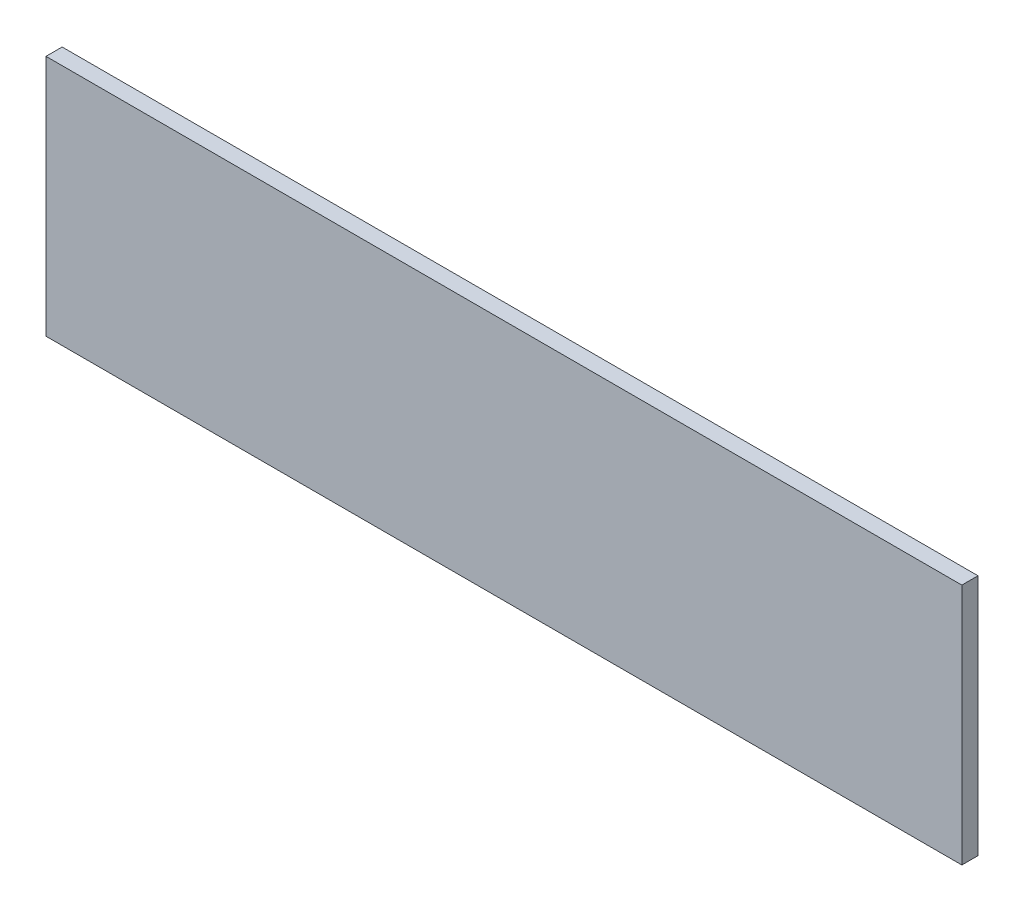
ISO-10303-21;
HEADER;
FILE_DESCRIPTION(('STEP AP214'),'2;1');
FILE_NAME('part.step','',(''),(''),'','','');
FILE_SCHEMA(('AUTOMOTIVE_DESIGN { 1 0 10303 214 1 1 1 1 }'));
ENDSEC;
DATA;
#1=APPLICATION_CONTEXT('core data for automotive mechanical design processes');
#2=APPLICATION_PROTOCOL_DEFINITION('international standard','automotive_design',2000,#1);
#3=PRODUCT_CONTEXT('',#1,'mechanical');
#4=PRODUCT('Part','Part','',(#3));
#5=PRODUCT_RELATED_PRODUCT_CATEGORY('part','',(#4));
#6=PRODUCT_DEFINITION_FORMATION('','',#4);
#7=PRODUCT_DEFINITION_CONTEXT('part definition',#1,'design');
#8=PRODUCT_DEFINITION('design','',#6,#7);
#9=PRODUCT_DEFINITION_SHAPE('','',#8);
#10=(LENGTH_UNIT() NAMED_UNIT(*) SI_UNIT(.MILLI.,.METRE.));
#11=(NAMED_UNIT(*) PLANE_ANGLE_UNIT() SI_UNIT($,.RADIAN.));
#12=(NAMED_UNIT(*) SI_UNIT($,.STERADIAN.) SOLID_ANGLE_UNIT());
#13=UNCERTAINTY_MEASURE_WITH_UNIT(LENGTH_MEASURE(1.E-05),#10,'distance_accuracy_value','');
#14=(GEOMETRIC_REPRESENTATION_CONTEXT(3) GLOBAL_UNCERTAINTY_ASSIGNED_CONTEXT((#13)) GLOBAL_UNIT_ASSIGNED_CONTEXT((#10,
#11,#12)) REPRESENTATION_CONTEXT('',''));
#15=CARTESIAN_POINT('',(0.,0.,0.));
#16=DIRECTION('',(0.,0.,1.));
#17=DIRECTION('',(1.,0.,0.));
#18=AXIS2_PLACEMENT_3D('',#15,#16,#17);
#19=CARTESIAN_POINT('',(0.,0.,3.));
#20=DIRECTION('',(1.,0.,0.));
#21=DIRECTION('',(0.,0.,-1.));
#22=AXIS2_PLACEMENT_3D('',#19,#20,#21);
#23=PLANE('',#22);
#24=DIRECTION('',(0.,-1.,0.));
#25=VECTOR('',#24,1.);
#26=CARTESIAN_POINT('',(0.,0.,0.));
#27=LINE('',#26,#25);
#28=CARTESIAN_POINT('',(0.,45.,0.));
#29=VERTEX_POINT('',#28);
#30=CARTESIAN_POINT('',(0.,0.,0.));
#31=VERTEX_POINT('',#30);
#32=EDGE_CURVE('E94',#29,#31,#27,.T.);
#33=ORIENTED_EDGE('',*,*,#32,.T.);
#34=DIRECTION('',(0.,0.,-1.));
#35=VECTOR('',#34,1.);
#36=CARTESIAN_POINT('',(0.,0.,3.));
#37=LINE('',#36,#35);
#38=CARTESIAN_POINT('',(0.,0.,3.));
#39=VERTEX_POINT('',#38);
#40=EDGE_CURVE('E11',#39,#31,#37,.T.);
#41=ORIENTED_EDGE('',*,*,#40,.F.);
#42=DIRECTION('',(0.,-1.,0.));
#43=VECTOR('',#42,1.);
#44=CARTESIAN_POINT('',(0.,0.,3.));
#45=LINE('',#44,#43);
#46=CARTESIAN_POINT('',(0.,45.,3.));
#47=VERTEX_POINT('',#46);
#48=EDGE_CURVE('E82',#47,#39,#45,.T.);
#49=ORIENTED_EDGE('',*,*,#48,.F.);
#50=DIRECTION('',(0.,0.,-1.));
#51=VECTOR('',#50,1.);
#52=CARTESIAN_POINT('',(0.,45.,3.));
#53=LINE('',#52,#51);
#54=EDGE_CURVE('E90',#47,#29,#53,.T.);
#55=ORIENTED_EDGE('',*,*,#54,.T.);
#56=EDGE_LOOP('',(#33,#41,#49,#55));
#57=FACE_BOUND('',#56,.T.);
#58=ADVANCED_FACE('F31',(#57),#23,.F.);
#59=CARTESIAN_POINT('',(0.,0.,3.));
#60=DIRECTION('',(0.,1.,0.));
#61=DIRECTION('',(0.,0.,1.));
#62=AXIS2_PLACEMENT_3D('',#59,#60,#61);
#63=PLANE('',#62);
#64=DIRECTION('',(1.,0.,0.));
#65=VECTOR('',#64,1.);
#66=CARTESIAN_POINT('',(0.,0.,0.));
#67=LINE('',#66,#65);
#68=CARTESIAN_POINT('',(170.,0.,0.));
#69=VERTEX_POINT('',#68);
#70=EDGE_CURVE('E86',#31,#69,#67,.T.);
#71=ORIENTED_EDGE('',*,*,#70,.T.);
#72=DIRECTION('',(0.,0.,-1.));
#73=VECTOR('',#72,1.);
#74=CARTESIAN_POINT('',(170.,0.,3.));
#75=LINE('',#74,#73);
#76=CARTESIAN_POINT('',(170.,0.,3.));
#77=VERTEX_POINT('',#76);
#78=EDGE_CURVE('E39',#77,#69,#75,.T.);
#79=ORIENTED_EDGE('',*,*,#78,.F.);
#80=DIRECTION('',(1.,0.,0.));
#81=VECTOR('',#80,1.);
#82=CARTESIAN_POINT('',(0.,0.,3.));
#83=LINE('',#82,#81);
#84=EDGE_CURVE('E77',#39,#77,#83,.T.);
#85=ORIENTED_EDGE('',*,*,#84,.F.);
#86=ORIENTED_EDGE('',*,*,#40,.T.);
#87=EDGE_LOOP('',(#71,#79,#85,#86));
#88=FACE_BOUND('',#87,.T.);
#89=ADVANCED_FACE('F85',(#88),#63,.F.);
#90=CARTESIAN_POINT('',(170.,0.,3.));
#91=DIRECTION('',(-1.,0.,0.));
#92=DIRECTION('',(0.,-1.,0.));
#93=AXIS2_PLACEMENT_3D('',#90,#91,#92);
#94=PLANE('',#93);
#95=DIRECTION('',(0.,1.,0.));
#96=VECTOR('',#95,1.);
#97=CARTESIAN_POINT('',(170.,0.,0.));
#98=LINE('',#97,#96);
#99=CARTESIAN_POINT('',(170.,45.,0.));
#100=VERTEX_POINT('',#99);
#101=EDGE_CURVE('E64',#69,#100,#98,.T.);
#102=ORIENTED_EDGE('',*,*,#101,.T.);
#103=DIRECTION('',(0.,0.,-1.));
#104=VECTOR('',#103,1.);
#105=CARTESIAN_POINT('',(170.,45.,3.));
#106=LINE('',#105,#104);
#107=CARTESIAN_POINT('',(170.,45.,3.));
#108=VERTEX_POINT('',#107);
#109=EDGE_CURVE('E87',#108,#100,#106,.T.);
#110=ORIENTED_EDGE('',*,*,#109,.F.);
#111=DIRECTION('',(0.,1.,0.));
#112=VECTOR('',#111,1.);
#113=CARTESIAN_POINT('',(170.,0.,3.));
#114=LINE('',#113,#112);
#115=EDGE_CURVE('E80',#77,#108,#114,.T.);
#116=ORIENTED_EDGE('',*,*,#115,.F.);
#117=ORIENTED_EDGE('',*,*,#78,.T.);
#118=EDGE_LOOP('',(#102,#110,#116,#117));
#119=FACE_BOUND('',#118,.T.);
#120=ADVANCED_FACE('F88',(#119),#94,.F.);
#121=CARTESIAN_POINT('',(0.,45.,3.));
#122=DIRECTION('',(0.,-1.,0.));
#123=DIRECTION('',(0.,0.,-1.));
#124=AXIS2_PLACEMENT_3D('',#121,#122,#123);
#125=PLANE('',#124);
#126=DIRECTION('',(-1.,0.,0.));
#127=VECTOR('',#126,1.);
#128=CARTESIAN_POINT('',(0.,45.,0.));
#129=LINE('',#128,#127);
#130=EDGE_CURVE('E70',#100,#29,#129,.T.);
#131=ORIENTED_EDGE('',*,*,#130,.T.);
#132=ORIENTED_EDGE('',*,*,#54,.F.);
#133=DIRECTION('',(-1.,0.,0.));
#134=VECTOR('',#133,1.);
#135=CARTESIAN_POINT('',(0.,45.,3.));
#136=LINE('',#135,#134);
#137=EDGE_CURVE('E47',#108,#47,#136,.T.);
#138=ORIENTED_EDGE('',*,*,#137,.F.);
#139=ORIENTED_EDGE('',*,*,#109,.T.);
#140=EDGE_LOOP('',(#131,#132,#138,#139));
#141=FACE_BOUND('',#140,.T.);
#142=ADVANCED_FACE('F101',(#141),#125,.F.);
#143=CARTESIAN_POINT('',(0.,45.,3.));
#144=DIRECTION('',(0.,0.,-1.));
#145=DIRECTION('',(-1.,0.,0.));
#146=AXIS2_PLACEMENT_3D('',#143,#144,#145);
#147=PLANE('',#146);
#148=ORIENTED_EDGE('',*,*,#48,.T.);
#149=ORIENTED_EDGE('',*,*,#84,.T.);
#150=ORIENTED_EDGE('',*,*,#115,.T.);
#151=ORIENTED_EDGE('',*,*,#137,.T.);
#152=EDGE_LOOP('',(#148,#149,#150,#151));
#153=FACE_BOUND('',#152,.T.);
#154=ADVANCED_FACE('F78',(#153),#147,.F.);
#155=CARTESIAN_POINT('',(0.,45.,0.));
#156=DIRECTION('',(0.,0.,-1.));
#157=DIRECTION('',(-1.,0.,0.));
#158=AXIS2_PLACEMENT_3D('',#155,#156,#157);
#159=PLANE('',#158);
#160=ORIENTED_EDGE('',*,*,#32,.F.);
#161=ORIENTED_EDGE('',*,*,#130,.F.);
#162=ORIENTED_EDGE('',*,*,#101,.F.);
#163=ORIENTED_EDGE('',*,*,#70,.F.);
#164=EDGE_LOOP('',(#160,#161,#162,#163));
#165=FACE_BOUND('',#164,.T.);
#166=ADVANCED_FACE('F104',(#165),#159,.T.);
#167=CLOSED_SHELL('',(#58,#89,#120,#142,#154,#166));
#168=MANIFOLD_SOLID_BREP('B2',#167);
#169=ADVANCED_BREP_SHAPE_REPRESENTATION('',(#18,#168),#14);
#170=SHAPE_DEFINITION_REPRESENTATION(#9,#169);
ENDSEC;
END-ISO-10303-21;
